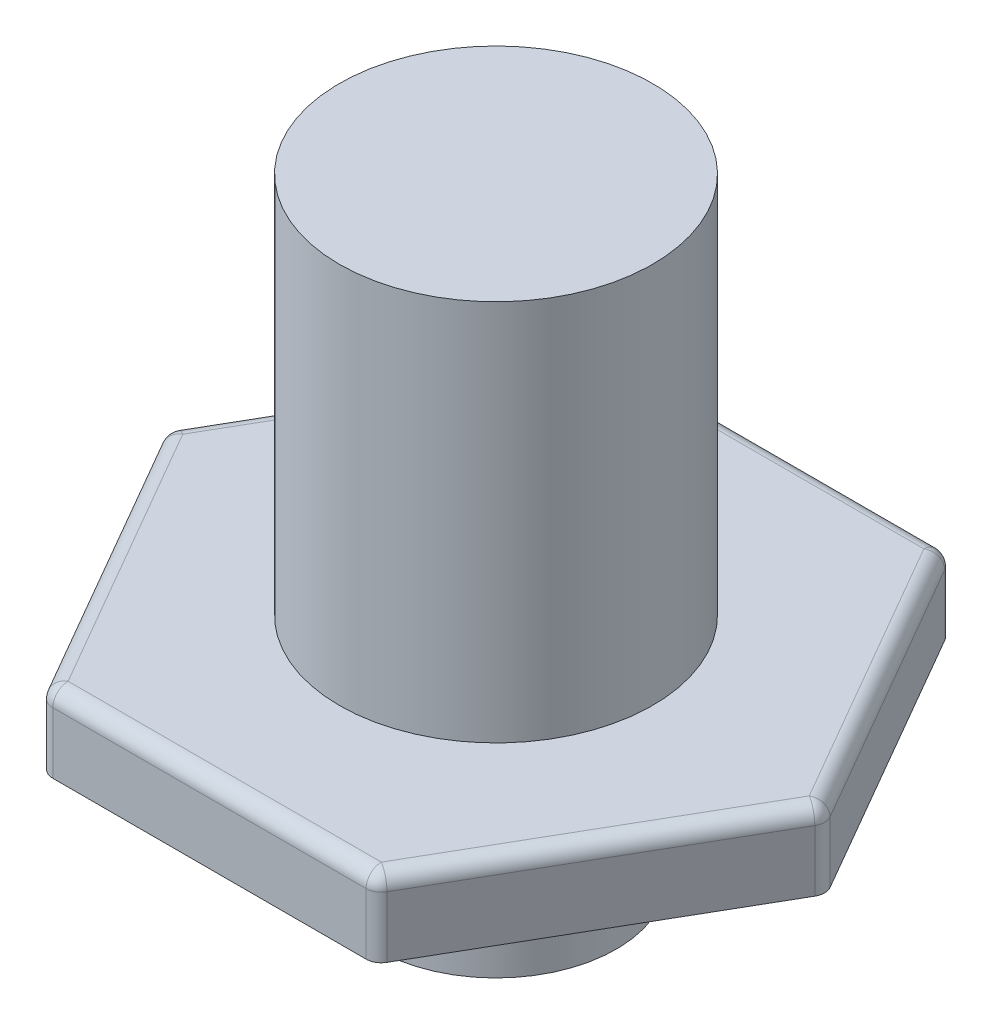
ISO-10303-21;
HEADER;
FILE_DESCRIPTION(('STEP AP214'),'2;1');
FILE_NAME('part.step','',(''),(''),'','','');
FILE_SCHEMA(('AUTOMOTIVE_DESIGN { 1 0 10303 214 1 1 1 1 }'));
ENDSEC;
DATA;
#1=APPLICATION_CONTEXT('core data for automotive mechanical design processes');
#2=APPLICATION_PROTOCOL_DEFINITION('international standard','automotive_design',2000,#1);
#3=PRODUCT_CONTEXT('',#1,'mechanical');
#4=PRODUCT('Part','Part','',(#3));
#5=PRODUCT_RELATED_PRODUCT_CATEGORY('part','',(#4));
#6=PRODUCT_DEFINITION_FORMATION('','',#4);
#7=PRODUCT_DEFINITION_CONTEXT('part definition',#1,'design');
#8=PRODUCT_DEFINITION('design','',#6,#7);
#9=PRODUCT_DEFINITION_SHAPE('','',#8);
#10=(LENGTH_UNIT() NAMED_UNIT(*) SI_UNIT(.MILLI.,.METRE.));
#11=(NAMED_UNIT(*) PLANE_ANGLE_UNIT() SI_UNIT($,.RADIAN.));
#12=(NAMED_UNIT(*) SI_UNIT($,.STERADIAN.) SOLID_ANGLE_UNIT());
#13=UNCERTAINTY_MEASURE_WITH_UNIT(LENGTH_MEASURE(1.E-05),#10,'distance_accuracy_value','');
#14=(GEOMETRIC_REPRESENTATION_CONTEXT(3) GLOBAL_UNCERTAINTY_ASSIGNED_CONTEXT((#13)) GLOBAL_UNIT_ASSIGNED_CONTEXT((#10,
#11,#12)) REPRESENTATION_CONTEXT('',''));
#15=CARTESIAN_POINT('',(0.,0.,0.));
#16=DIRECTION('',(0.,0.,1.));
#17=DIRECTION('',(1.,0.,0.));
#18=AXIS2_PLACEMENT_3D('',#15,#16,#17);
#19=CARTESIAN_POINT('',(5.49926131403119,2.54,9.525));
#20=DIRECTION('',(-0.866025403784439,0.,-0.5));
#21=DIRECTION('',(-0.5,0.,0.866025403784439));
#22=AXIS2_PLACEMENT_3D('',#19,#20,#21);
#23=PLANE('',#22);
#24=DIRECTION('',(0.5,0.,-0.866025403784439));
#25=VECTOR('',#24,1.);
#26=CARTESIAN_POINT('',(5.49926131403119,0.,9.525));
#27=LINE('',#26,#25);
#28=CARTESIAN_POINT('',(5.64590828240535,0.,9.271));
#29=VERTEX_POINT('',#28);
#30=CARTESIAN_POINT('',(10.8518756596882,0.,0.253999999999996));
#31=VERTEX_POINT('',#30);
#32=EDGE_CURVE('E222',#29,#31,#27,.T.);
#33=ORIENTED_EDGE('',*,*,#32,.T.);
#34=DIRECTION('',(0.,-1.,0.));
#35=VECTOR('',#34,1.);
#36=CARTESIAN_POINT('',(10.8518756596882,2.54,0.253999999999997));
#37=LINE('',#36,#35);
#38=CARTESIAN_POINT('',(10.8518756596882,2.032,0.253999999999998));
#39=VERTEX_POINT('',#38);
#40=EDGE_CURVE('E263',#31,#39,#37,.F.);
#41=ORIENTED_EDGE('',*,*,#40,.T.);
#42=DIRECTION('',(0.5,0.,-0.866025403784439));
#43=VECTOR('',#42,1.);
#44=CARTESIAN_POINT('',(5.49926131403119,2.032,9.525));
#45=LINE('',#44,#43);
#46=CARTESIAN_POINT('',(5.64590828240535,2.032,9.271));
#47=VERTEX_POINT('',#46);
#48=EDGE_CURVE('E257',#39,#47,#45,.F.);
#49=ORIENTED_EDGE('',*,*,#48,.T.);
#50=DIRECTION('',(0.,-1.,0.));
#51=VECTOR('',#50,1.);
#52=CARTESIAN_POINT('',(5.64590828240535,2.54,9.271));
#53=LINE('',#52,#51);
#54=EDGE_CURVE('E260',#47,#29,#53,.T.);
#55=ORIENTED_EDGE('',*,*,#54,.T.);
#56=EDGE_LOOP('',(#33,#41,#49,#55));
#57=FACE_BOUND('',#56,.T.);
#58=ADVANCED_FACE('F42',(#57),#23,.F.);
#59=CARTESIAN_POINT('',(10.9985226280624,2.54,0.));
#60=DIRECTION('',(-0.866025403784439,0.,0.5));
#61=DIRECTION('',(0.5,0.,0.866025403784439));
#62=AXIS2_PLACEMENT_3D('',#59,#60,#61);
#63=PLANE('',#62);
#64=DIRECTION('',(-0.5,0.,-0.866025403784439));
#65=VECTOR('',#64,1.);
#66=CARTESIAN_POINT('',(10.9985226280624,0.,0.));
#67=LINE('',#66,#65);
#68=CARTESIAN_POINT('',(10.8518756596882,0.,-0.254));
#69=VERTEX_POINT('',#68);
#70=CARTESIAN_POINT('',(5.64590828240535,0.,-9.271));
#71=VERTEX_POINT('',#70);
#72=EDGE_CURVE('E213',#69,#71,#67,.T.);
#73=ORIENTED_EDGE('',*,*,#72,.T.);
#74=DIRECTION('',(0.,-1.,0.));
#75=VECTOR('',#74,1.);
#76=CARTESIAN_POINT('',(5.64590828240535,2.54,-9.271));
#77=LINE('',#76,#75);
#78=CARTESIAN_POINT('',(5.64590828240535,2.032,-9.271));
#79=VERTEX_POINT('',#78);
#80=EDGE_CURVE('E188',#71,#79,#77,.F.);
#81=ORIENTED_EDGE('',*,*,#80,.T.);
#82=DIRECTION('',(-0.5,0.,-0.866025403784439));
#83=VECTOR('',#82,1.);
#84=CARTESIAN_POINT('',(10.9985226280624,2.032,0.));
#85=LINE('',#84,#83);
#86=CARTESIAN_POINT('',(10.8518756596882,2.032,-0.254));
#87=VERTEX_POINT('',#86);
#88=EDGE_CURVE('E194',#79,#87,#85,.F.);
#89=ORIENTED_EDGE('',*,*,#88,.T.);
#90=DIRECTION('',(0.,-1.,0.));
#91=VECTOR('',#90,1.);
#92=CARTESIAN_POINT('',(10.8518756596882,2.54,-0.254));
#93=LINE('',#92,#91);
#94=EDGE_CURVE('E252',#87,#69,#93,.T.);
#95=ORIENTED_EDGE('',*,*,#94,.T.);
#96=EDGE_LOOP('',(#73,#81,#89,#95));
#97=FACE_BOUND('',#96,.T.);
#98=ADVANCED_FACE('F468',(#97),#63,.F.);
#99=CARTESIAN_POINT('',(5.49926131403119,2.54,-9.525));
#100=DIRECTION('',(0.,0.,1.));
#101=DIRECTION('',(1.,0.,0.));
#102=AXIS2_PLACEMENT_3D('',#99,#100,#101);
#103=PLANE('',#102);
#104=DIRECTION('',(-1.,0.,0.));
#105=VECTOR('',#104,1.);
#106=CARTESIAN_POINT('',(5.49926131403119,2.032,-9.525));
#107=LINE('',#106,#105);
#108=CARTESIAN_POINT('',(-5.20596737728286,2.032,-9.525));
#109=VERTEX_POINT('',#108);
#110=CARTESIAN_POINT('',(5.20596737728286,2.032,-9.525));
#111=VERTEX_POINT('',#110);
#112=EDGE_CURVE('E202',#109,#111,#107,.F.);
#113=ORIENTED_EDGE('',*,*,#112,.T.);
#114=DIRECTION('',(0.,-1.,0.));
#115=VECTOR('',#114,1.);
#116=CARTESIAN_POINT('',(5.20596737728286,2.54,-9.525));
#117=LINE('',#116,#115);
#118=CARTESIAN_POINT('',(5.20596737728286,0.,-9.525));
#119=VERTEX_POINT('',#118);
#120=EDGE_CURVE('E187',#111,#119,#117,.T.);
#121=ORIENTED_EDGE('',*,*,#120,.T.);
#122=DIRECTION('',(-1.,0.,0.));
#123=VECTOR('',#122,1.);
#124=CARTESIAN_POINT('',(5.49926131403119,0.,-9.525));
#125=LINE('',#124,#123);
#126=CARTESIAN_POINT('',(-5.20596737728286,0.,-9.525));
#127=VERTEX_POINT('',#126);
#128=EDGE_CURVE('E200',#119,#127,#125,.T.);
#129=ORIENTED_EDGE('',*,*,#128,.T.);
#130=DIRECTION('',(0.,-1.,0.));
#131=VECTOR('',#130,1.);
#132=CARTESIAN_POINT('',(-5.20596737728286,2.54,-9.525));
#133=LINE('',#132,#131);
#134=EDGE_CURVE('E206',#127,#109,#133,.F.);
#135=ORIENTED_EDGE('',*,*,#134,.T.);
#136=EDGE_LOOP('',(#113,#121,#129,#135));
#137=FACE_BOUND('',#136,.T.);
#138=ADVANCED_FACE('F199',(#137),#103,.F.);
#139=CARTESIAN_POINT('',(-5.49926131403119,2.54,-9.525));
#140=DIRECTION('',(0.866025403784439,0.,0.5));
#141=DIRECTION('',(0.5,0.,-0.866025403784439));
#142=AXIS2_PLACEMENT_3D('',#139,#140,#141);
#143=PLANE('',#142);
#144=DIRECTION('',(-0.5,0.,0.866025403784439));
#145=VECTOR('',#144,1.);
#146=CARTESIAN_POINT('',(-5.49926131403119,0.,-9.525));
#147=LINE('',#146,#145);
#148=CARTESIAN_POINT('',(-5.64590828240535,0.,-9.271));
#149=VERTEX_POINT('',#148);
#150=CARTESIAN_POINT('',(-10.8518756596882,0.,-0.254000000000001));
#151=VERTEX_POINT('',#150);
#152=EDGE_CURVE('E212',#149,#151,#147,.T.);
#153=ORIENTED_EDGE('',*,*,#152,.T.);
#154=DIRECTION('',(0.,-1.,0.));
#155=VECTOR('',#154,1.);
#156=CARTESIAN_POINT('',(-10.8518756596882,2.54,-0.253999999999999));
#157=LINE('',#156,#155);
#158=CARTESIAN_POINT('',(-10.8518756596882,2.032,-0.253999999999999));
#159=VERTEX_POINT('',#158);
#160=EDGE_CURVE('E289',#151,#159,#157,.F.);
#161=ORIENTED_EDGE('',*,*,#160,.T.);
#162=DIRECTION('',(-0.5,0.,0.866025403784439));
#163=VECTOR('',#162,1.);
#164=CARTESIAN_POINT('',(-5.49926131403119,2.032,-9.52500000000001));
#165=LINE('',#164,#163);
#166=CARTESIAN_POINT('',(-5.64590828240535,2.032,-9.271));
#167=VERTEX_POINT('',#166);
#168=EDGE_CURVE('E284',#159,#167,#165,.F.);
#169=ORIENTED_EDGE('',*,*,#168,.T.);
#170=DIRECTION('',(0.,-1.,0.));
#171=VECTOR('',#170,1.);
#172=CARTESIAN_POINT('',(-5.64590828240535,2.54,-9.271));
#173=LINE('',#172,#171);
#174=EDGE_CURVE('E286',#167,#149,#173,.T.);
#175=ORIENTED_EDGE('',*,*,#174,.T.);
#176=EDGE_LOOP('',(#153,#161,#169,#175));
#177=FACE_BOUND('',#176,.T.);
#178=ADVANCED_FACE('F453',(#177),#143,.F.);
#179=CARTESIAN_POINT('',(-10.9985226280624,2.54,0.));
#180=DIRECTION('',(0.866025403784439,0.,-0.5));
#181=DIRECTION('',(-0.5,0.,-0.866025403784439));
#182=AXIS2_PLACEMENT_3D('',#179,#180,#181);
#183=PLANE('',#182);
#184=DIRECTION('',(0.5,0.,0.866025403784439));
#185=VECTOR('',#184,1.);
#186=CARTESIAN_POINT('',(-10.9985226280624,0.,0.));
#187=LINE('',#186,#185);
#188=CARTESIAN_POINT('',(-10.8518756596882,0.,0.254000000000001));
#189=VERTEX_POINT('',#188);
#190=CARTESIAN_POINT('',(-5.64590828240535,0.,9.271));
#191=VERTEX_POINT('',#190);
#192=EDGE_CURVE('E219',#189,#191,#187,.T.);
#193=ORIENTED_EDGE('',*,*,#192,.T.);
#194=DIRECTION('',(0.,-1.,0.));
#195=VECTOR('',#194,1.);
#196=CARTESIAN_POINT('',(-5.64590828240535,2.54,9.271));
#197=LINE('',#196,#195);
#198=CARTESIAN_POINT('',(-5.64590828240535,2.032,9.271));
#199=VERTEX_POINT('',#198);
#200=EDGE_CURVE('E281',#191,#199,#197,.F.);
#201=ORIENTED_EDGE('',*,*,#200,.T.);
#202=DIRECTION('',(0.5,0.,0.866025403784439));
#203=VECTOR('',#202,1.);
#204=CARTESIAN_POINT('',(-10.9985226280624,2.032,0.));
#205=LINE('',#204,#203);
#206=CARTESIAN_POINT('',(-10.8518756596882,2.032,0.254000000000001));
#207=VERTEX_POINT('',#206);
#208=EDGE_CURVE('E275',#199,#207,#205,.F.);
#209=ORIENTED_EDGE('',*,*,#208,.T.);
#210=DIRECTION('',(0.,-1.,0.));
#211=VECTOR('',#210,1.);
#212=CARTESIAN_POINT('',(-10.8518756596882,2.54,0.254000000000001));
#213=LINE('',#212,#211);
#214=EDGE_CURVE('E278',#207,#189,#213,.T.);
#215=ORIENTED_EDGE('',*,*,#214,.T.);
#216=EDGE_LOOP('',(#193,#201,#209,#215));
#217=FACE_BOUND('',#216,.T.);
#218=ADVANCED_FACE('F434',(#217),#183,.F.);
#219=CARTESIAN_POINT('',(-5.49926131403119,2.54,9.525));
#220=DIRECTION('',(0.,0.,-1.));
#221=DIRECTION('',(-1.,0.,0.));
#222=AXIS2_PLACEMENT_3D('',#219,#220,#221);
#223=PLANE('',#222);
#224=DIRECTION('',(1.,0.,0.));
#225=VECTOR('',#224,1.);
#226=CARTESIAN_POINT('',(-5.49926131403119,0.,9.525));
#227=LINE('',#226,#225);
#228=CARTESIAN_POINT('',(-5.20596737728286,0.,9.525));
#229=VERTEX_POINT('',#228);
#230=CARTESIAN_POINT('',(5.20596737728286,0.,9.525));
#231=VERTEX_POINT('',#230);
#232=EDGE_CURVE('E229',#229,#231,#227,.T.);
#233=ORIENTED_EDGE('',*,*,#232,.T.);
#234=DIRECTION('',(0.,-1.,0.));
#235=VECTOR('',#234,1.);
#236=CARTESIAN_POINT('',(5.20596737728286,2.54,9.525));
#237=LINE('',#236,#235);
#238=CARTESIAN_POINT('',(5.20596737728286,2.032,9.525));
#239=VERTEX_POINT('',#238);
#240=EDGE_CURVE('E272',#231,#239,#237,.F.);
#241=ORIENTED_EDGE('',*,*,#240,.T.);
#242=DIRECTION('',(1.,0.,0.));
#243=VECTOR('',#242,1.);
#244=CARTESIAN_POINT('',(-5.49926131403119,2.032,9.525));
#245=LINE('',#244,#243);
#246=CARTESIAN_POINT('',(-5.20596737728286,2.032,9.525));
#247=VERTEX_POINT('',#246);
#248=EDGE_CURVE('E266',#239,#247,#245,.F.);
#249=ORIENTED_EDGE('',*,*,#248,.T.);
#250=DIRECTION('',(0.,-1.,0.));
#251=VECTOR('',#250,1.);
#252=CARTESIAN_POINT('',(-5.20596737728286,2.54,9.525));
#253=LINE('',#252,#251);
#254=EDGE_CURVE('E269',#247,#229,#253,.T.);
#255=ORIENTED_EDGE('',*,*,#254,.T.);
#256=EDGE_LOOP('',(#233,#241,#249,#255));
#257=FACE_BOUND('',#256,.T.);
#258=ADVANCED_FACE('F426',(#257),#223,.F.);
#259=CARTESIAN_POINT('',(0.,2.54,0.));
#260=DIRECTION('',(0.,1.,0.));
#261=DIRECTION('',(0.,0.,1.));
#262=AXIS2_PLACEMENT_3D('',#259,#260,#261);
#263=PLANE('',#262);
#264=DIRECTION('',(-0.5,0.,-0.866025403784439));
#265=VECTOR('',#264,1.);
#266=CARTESIAN_POINT('',(5.05932040890869,2.54,-9.271));
#267=LINE('',#266,#265);
#268=CARTESIAN_POINT('',(10.4119347545657,2.54,0.));
#269=VERTEX_POINT('',#268);
#270=CARTESIAN_POINT('',(5.20596737728286,2.54,-9.017));
#271=VERTEX_POINT('',#270);
#272=EDGE_CURVE('E298',#269,#271,#267,.T.);
#273=ORIENTED_EDGE('',*,*,#272,.T.);
#274=DIRECTION('',(-1.,0.,0.));
#275=VECTOR('',#274,1.);
#276=CARTESIAN_POINT('',(-5.49926131403119,2.54,-9.017));
#277=LINE('',#276,#275);
#278=CARTESIAN_POINT('',(-5.20596737728286,2.54,-9.017));
#279=VERTEX_POINT('',#278);
#280=EDGE_CURVE('E11',#271,#279,#277,.T.);
#281=ORIENTED_EDGE('',*,*,#280,.T.);
#282=DIRECTION('',(-0.5,0.,0.866025403784439));
#283=VECTOR('',#282,1.);
#284=CARTESIAN_POINT('',(-10.5585817229399,2.54,0.254));
#285=LINE('',#284,#283);
#286=CARTESIAN_POINT('',(-10.4119347545657,2.54,0.));
#287=VERTEX_POINT('',#286);
#288=EDGE_CURVE('E52',#279,#287,#285,.T.);
#289=ORIENTED_EDGE('',*,*,#288,.T.);
#290=DIRECTION('',(0.5,0.,0.866025403784439));
#291=VECTOR('',#290,1.);
#292=CARTESIAN_POINT('',(-5.05932040890869,2.54,9.271));
#293=LINE('',#292,#291);
#294=CARTESIAN_POINT('',(-5.20596737728286,2.54,9.017));
#295=VERTEX_POINT('',#294);
#296=EDGE_CURVE('E301',#287,#295,#293,.T.);
#297=ORIENTED_EDGE('',*,*,#296,.T.);
#298=DIRECTION('',(1.,0.,0.));
#299=VECTOR('',#298,1.);
#300=CARTESIAN_POINT('',(5.49926131403119,2.54,9.017));
#301=LINE('',#300,#299);
#302=CARTESIAN_POINT('',(5.20596737728286,2.54,9.017));
#303=VERTEX_POINT('',#302);
#304=EDGE_CURVE('E295',#295,#303,#301,.T.);
#305=ORIENTED_EDGE('',*,*,#304,.T.);
#306=DIRECTION('',(0.5,0.,-0.866025403784439));
#307=VECTOR('',#306,1.);
#308=CARTESIAN_POINT('',(10.5585817229399,2.54,-0.254));
#309=LINE('',#308,#307);
#310=EDGE_CURVE('E292',#303,#269,#309,.T.);
#311=ORIENTED_EDGE('',*,*,#310,.T.);
#312=EDGE_LOOP('',(#273,#281,#289,#297,#305,#311));
#313=FACE_BOUND('',#312,.T.);
#314=CARTESIAN_POINT('',(0.,2.54,0.));
#315=DIRECTION('',(0.,1.,0.));
#316=DIRECTION('',(0.,0.,1.));
#317=AXIS2_PLACEMENT_3D('',#314,#315,#316);
#318=CIRCLE('',#317,5.207);
#319=CARTESIAN_POINT('',(0.,2.54,5.207));
#320=VERTEX_POINT('',#319);
#321=EDGE_CURVE('E380',#320,#320,#318,.T.);
#322=ORIENTED_EDGE('',*,*,#321,.F.);
#323=EDGE_LOOP('',(#322));
#324=FACE_BOUND('',#323,.T.);
#325=ADVANCED_FACE('F535',(#313,#324),#263,.T.);
#326=CARTESIAN_POINT('',(0.,0.,0.));
#327=DIRECTION('',(0.,1.,0.));
#328=DIRECTION('',(0.,0.,1.));
#329=AXIS2_PLACEMENT_3D('',#326,#327,#328);
#330=PLANE('',#329);
#331=CARTESIAN_POINT('',(0.,0.,0.));
#332=DIRECTION('',(0.,-1.,0.));
#333=DIRECTION('',(0.,0.,-1.));
#334=AXIS2_PLACEMENT_3D('',#331,#332,#333);
#335=CIRCLE('',#334,4.);
#336=CARTESIAN_POINT('',(0.,0.,-4.));
#337=VERTEX_POINT('',#336);
#338=EDGE_CURVE('E233',#337,#337,#335,.T.);
#339=ORIENTED_EDGE('',*,*,#338,.F.);
#340=EDGE_LOOP('',(#339));
#341=FACE_BOUND('',#340,.T.);
#342=ORIENTED_EDGE('',*,*,#128,.F.);
#343=CARTESIAN_POINT('',(5.20596737728286,0.,-9.017));
#344=DIRECTION('',(0.,1.,0.));
#345=DIRECTION('',(0.,0.,1.));
#346=AXIS2_PLACEMENT_3D('',#343,#344,#345);
#347=CIRCLE('',#346,0.508);
#348=EDGE_CURVE('E183',#119,#71,#347,.F.);
#349=ORIENTED_EDGE('',*,*,#348,.T.);
#350=ORIENTED_EDGE('',*,*,#72,.F.);
#351=CARTESIAN_POINT('',(10.4119347545657,0.,0.));
#352=DIRECTION('',(0.,1.,0.));
#353=DIRECTION('',(0.,0.,1.));
#354=AXIS2_PLACEMENT_3D('',#351,#352,#353);
#355=CIRCLE('',#354,0.508);
#356=EDGE_CURVE('E195',#69,#31,#355,.F.);
#357=ORIENTED_EDGE('',*,*,#356,.T.);
#358=ORIENTED_EDGE('',*,*,#32,.F.);
#359=CARTESIAN_POINT('',(5.20596737728286,0.,9.017));
#360=DIRECTION('',(0.,1.,0.));
#361=DIRECTION('',(0.,0.,1.));
#362=AXIS2_PLACEMENT_3D('',#359,#360,#361);
#363=CIRCLE('',#362,0.508);
#364=EDGE_CURVE('E245',#29,#231,#363,.F.);
#365=ORIENTED_EDGE('',*,*,#364,.T.);
#366=ORIENTED_EDGE('',*,*,#232,.F.);
#367=CARTESIAN_POINT('',(-5.20596737728286,0.,9.017));
#368=DIRECTION('',(0.,1.,0.));
#369=DIRECTION('',(0.,0.,1.));
#370=AXIS2_PLACEMENT_3D('',#367,#368,#369);
#371=CIRCLE('',#370,0.508);
#372=EDGE_CURVE('E242',#229,#191,#371,.F.);
#373=ORIENTED_EDGE('',*,*,#372,.T.);
#374=ORIENTED_EDGE('',*,*,#192,.F.);
#375=CARTESIAN_POINT('',(-10.4119347545657,0.,0.));
#376=DIRECTION('',(0.,1.,0.));
#377=DIRECTION('',(0.,0.,1.));
#378=AXIS2_PLACEMENT_3D('',#375,#376,#377);
#379=CIRCLE('',#378,0.508);
#380=EDGE_CURVE('E239',#189,#151,#379,.F.);
#381=ORIENTED_EDGE('',*,*,#380,.T.);
#382=ORIENTED_EDGE('',*,*,#152,.F.);
#383=CARTESIAN_POINT('',(-5.20596737728286,0.,-9.017));
#384=DIRECTION('',(0.,1.,0.));
#385=DIRECTION('',(0.,0.,1.));
#386=AXIS2_PLACEMENT_3D('',#383,#384,#385);
#387=CIRCLE('',#386,0.508);
#388=EDGE_CURVE('E205',#149,#127,#387,.F.);
#389=ORIENTED_EDGE('',*,*,#388,.T.);
#390=EDGE_LOOP('',(#342,#349,#350,#357,#358,#365,#366,#373,#374,#381,#382,#389));
#391=FACE_BOUND('',#390,.T.);
#392=ADVANCED_FACE('F208',(#341,#391),#330,.F.);
#393=CARTESIAN_POINT('',(0.,15.24,0.));
#394=DIRECTION('',(0.,-1.,0.));
#395=DIRECTION('',(0.,0.,-1.));
#396=AXIS2_PLACEMENT_3D('',#393,#394,#395);
#397=CYLINDRICAL_SURFACE('',#396,5.207);
#398=CARTESIAN_POINT('',(0.,15.24,0.));
#399=DIRECTION('',(0.,1.,0.));
#400=DIRECTION('',(0.,0.,1.));
#401=AXIS2_PLACEMENT_3D('',#398,#399,#400);
#402=CIRCLE('',#401,5.207);
#403=CARTESIAN_POINT('',(0.,15.24,5.207));
#404=VERTEX_POINT('',#403);
#405=EDGE_CURVE('E386',#404,#404,#402,.T.);
#406=ORIENTED_EDGE('',*,*,#405,.F.);
#407=EDGE_LOOP('',(#406));
#408=FACE_BOUND('',#407,.T.);
#409=ORIENTED_EDGE('',*,*,#321,.T.);
#410=EDGE_LOOP('',(#409));
#411=FACE_BOUND('',#410,.T.);
#412=ADVANCED_FACE('F530',(#408,#411),#397,.T.);
#413=CARTESIAN_POINT('',(0.,15.24,0.));
#414=DIRECTION('',(0.,1.,0.));
#415=DIRECTION('',(0.,0.,1.));
#416=AXIS2_PLACEMENT_3D('',#413,#414,#415);
#417=PLANE('',#416);
#418=ORIENTED_EDGE('',*,*,#405,.T.);
#419=EDGE_LOOP('',(#418));
#420=FACE_BOUND('',#419,.T.);
#421=ADVANCED_FACE('F524',(#420),#417,.T.);
#422=CARTESIAN_POINT('',(0.,-5.08,0.));
#423=DIRECTION('',(0.,1.,0.));
#424=DIRECTION('',(0.,0.,1.));
#425=AXIS2_PLACEMENT_3D('',#422,#423,#424);
#426=CYLINDRICAL_SURFACE('',#425,4.);
#427=CARTESIAN_POINT('',(0.,-5.08,0.));
#428=DIRECTION('',(0.,-1.,0.));
#429=DIRECTION('',(0.,0.,-1.));
#430=AXIS2_PLACEMENT_3D('',#427,#428,#429);
#431=CIRCLE('',#430,4.);
#432=CARTESIAN_POINT('',(0.,-5.08,-4.));
#433=VERTEX_POINT('',#432);
#434=EDGE_CURVE('E374',#433,#433,#431,.T.);
#435=ORIENTED_EDGE('',*,*,#434,.F.);
#436=EDGE_LOOP('',(#435));
#437=FACE_BOUND('',#436,.T.);
#438=ORIENTED_EDGE('',*,*,#338,.T.);
#439=EDGE_LOOP('',(#438));
#440=FACE_BOUND('',#439,.T.);
#441=ADVANCED_FACE('F519',(#437,#440),#426,.T.);
#442=CARTESIAN_POINT('',(0.,-5.08,0.));
#443=DIRECTION('',(0.,-1.,0.));
#444=DIRECTION('',(0.,0.,-1.));
#445=AXIS2_PLACEMENT_3D('',#442,#443,#444);
#446=PLANE('',#445);
#447=ORIENTED_EDGE('',*,*,#434,.T.);
#448=EDGE_LOOP('',(#447));
#449=FACE_BOUND('',#448,.T.);
#450=ADVANCED_FACE('F515',(#449),#446,.T.);
#451=CARTESIAN_POINT('',(-5.20596737728286,2.54,9.017));
#452=DIRECTION('',(0.,-1.,0.));
#453=DIRECTION('',(0.,0.,-1.));
#454=AXIS2_PLACEMENT_3D('',#451,#452,#453);
#455=CYLINDRICAL_SURFACE('',#454,0.508);
#456=CARTESIAN_POINT('',(-5.20596737728286,2.032,9.017));
#457=DIRECTION('',(0.,1.,0.));
#458=DIRECTION('',(0.,0.,1.));
#459=AXIS2_PLACEMENT_3D('',#456,#457,#458);
#460=CIRCLE('',#459,0.508);
#461=EDGE_CURVE('E46',#199,#247,#460,.T.);
#462=ORIENTED_EDGE('',*,*,#461,.F.);
#463=ORIENTED_EDGE('',*,*,#200,.F.);
#464=ORIENTED_EDGE('',*,*,#372,.F.);
#465=ORIENTED_EDGE('',*,*,#254,.F.);
#466=EDGE_LOOP('',(#462,#463,#464,#465));
#467=FACE_BOUND('',#466,.T.);
#468=ADVANCED_FACE('F44',(#467),#455,.T.);
#469=CARTESIAN_POINT('',(-5.20596737728286,2.032,9.017));
#470=DIRECTION('',(0.,0.,1.));
#471=DIRECTION('',(1.,0.,0.));
#472=AXIS2_PLACEMENT_3D('',#469,#470,#471);
#473=SPHERICAL_SURFACE('',#472,0.508);
#474=CARTESIAN_POINT('',(-5.20596737728286,2.032,9.017));
#475=DIRECTION('',(0.500000000000002,0.,0.866025403784437));
#476=DIRECTION('',(0.866025403784437,0.,-0.500000000000003));
#477=AXIS2_PLACEMENT_3D('',#474,#475,#476);
#478=CIRCLE('',#477,0.508);
#479=EDGE_CURVE('E362',#199,#295,#478,.F.);
#480=ORIENTED_EDGE('',*,*,#479,.F.);
#481=ORIENTED_EDGE('',*,*,#461,.T.);
#482=CARTESIAN_POINT('',(-5.20596737728286,2.032,9.017));
#483=DIRECTION('',(-1.,0.,0.));
#484=DIRECTION('',(0.,-1.,0.));
#485=AXIS2_PLACEMENT_3D('',#482,#483,#484);
#486=CIRCLE('',#485,0.508);
#487=EDGE_CURVE('E365',#295,#247,#486,.F.);
#488=ORIENTED_EDGE('',*,*,#487,.F.);
#489=EDGE_LOOP('',(#480,#481,#488));
#490=FACE_BOUND('',#489,.T.);
#491=ADVANCED_FACE('F510',(#490),#473,.T.);
#492=CARTESIAN_POINT('',(5.20596737728286,2.54,9.017));
#493=DIRECTION('',(0.,-1.,0.));
#494=DIRECTION('',(0.,0.,-1.));
#495=AXIS2_PLACEMENT_3D('',#492,#493,#494);
#496=CYLINDRICAL_SURFACE('',#495,0.508);
#497=ORIENTED_EDGE('',*,*,#364,.F.);
#498=ORIENTED_EDGE('',*,*,#54,.F.);
#499=CARTESIAN_POINT('',(5.20596737728286,2.032,9.017));
#500=DIRECTION('',(0.,1.,0.));
#501=DIRECTION('',(0.,0.,1.));
#502=AXIS2_PLACEMENT_3D('',#499,#500,#501);
#503=CIRCLE('',#502,0.508);
#504=EDGE_CURVE('E358',#239,#47,#503,.T.);
#505=ORIENTED_EDGE('',*,*,#504,.F.);
#506=ORIENTED_EDGE('',*,*,#240,.F.);
#507=EDGE_LOOP('',(#497,#498,#505,#506));
#508=FACE_BOUND('',#507,.T.);
#509=ADVANCED_FACE('F418',(#508),#496,.T.);
#510=CARTESIAN_POINT('',(0.,2.032,9.017));
#511=DIRECTION('',(-1.,0.,0.));
#512=DIRECTION('',(0.,0.,1.));
#513=AXIS2_PLACEMENT_3D('',#510,#511,#512);
#514=CYLINDRICAL_SURFACE('',#513,0.508);
#515=ORIENTED_EDGE('',*,*,#487,.T.);
#516=ORIENTED_EDGE('',*,*,#248,.F.);
#517=CARTESIAN_POINT('',(5.20596737728286,2.032,9.017));
#518=DIRECTION('',(1.,0.,0.));
#519=DIRECTION('',(0.,0.,-1.));
#520=AXIS2_PLACEMENT_3D('',#517,#518,#519);
#521=CIRCLE('',#520,0.508);
#522=EDGE_CURVE('E354',#303,#239,#521,.T.);
#523=ORIENTED_EDGE('',*,*,#522,.F.);
#524=ORIENTED_EDGE('',*,*,#304,.F.);
#525=EDGE_LOOP('',(#515,#516,#523,#524));
#526=FACE_BOUND('',#525,.T.);
#527=ADVANCED_FACE('F423',(#526),#514,.T.);
#528=CARTESIAN_POINT('',(-7.80895106592429,2.032,4.5085));
#529=DIRECTION('',(-0.5,0.,-0.866025403784439));
#530=DIRECTION('',(-0.866025403784439,0.,0.5));
#531=AXIS2_PLACEMENT_3D('',#528,#529,#530);
#532=CYLINDRICAL_SURFACE('',#531,0.508);
#533=ORIENTED_EDGE('',*,*,#479,.T.);
#534=ORIENTED_EDGE('',*,*,#296,.F.);
#535=CARTESIAN_POINT('',(-10.4119347545657,2.032,0.));
#536=DIRECTION('',(-0.500000000000001,0.,-0.866025403784438));
#537=DIRECTION('',(-0.866025403784438,0.,0.500000000000001));
#538=AXIS2_PLACEMENT_3D('',#535,#536,#537);
#539=CIRCLE('',#538,0.508);
#540=EDGE_CURVE('E350',#207,#287,#539,.T.);
#541=ORIENTED_EDGE('',*,*,#540,.F.);
#542=ORIENTED_EDGE('',*,*,#208,.F.);
#543=EDGE_LOOP('',(#533,#534,#541,#542));
#544=FACE_BOUND('',#543,.T.);
#545=ADVANCED_FACE('F444',(#544),#532,.T.);
#546=CARTESIAN_POINT('',(-10.4119347545657,2.54,0.));
#547=DIRECTION('',(0.,-1.,0.));
#548=DIRECTION('',(0.,0.,-1.));
#549=AXIS2_PLACEMENT_3D('',#546,#547,#548);
#550=CYLINDRICAL_SURFACE('',#549,0.508);
#551=ORIENTED_EDGE('',*,*,#380,.F.);
#552=ORIENTED_EDGE('',*,*,#214,.F.);
#553=CARTESIAN_POINT('',(-10.4119347545657,2.032,0.));
#554=DIRECTION('',(0.,1.,0.));
#555=DIRECTION('',(0.,0.,1.));
#556=AXIS2_PLACEMENT_3D('',#553,#554,#555);
#557=CIRCLE('',#556,0.508);
#558=EDGE_CURVE('E346',#159,#207,#557,.T.);
#559=ORIENTED_EDGE('',*,*,#558,.F.);
#560=ORIENTED_EDGE('',*,*,#160,.F.);
#561=EDGE_LOOP('',(#551,#552,#559,#560));
#562=FACE_BOUND('',#561,.T.);
#563=ADVANCED_FACE('F440',(#562),#550,.T.);
#564=CARTESIAN_POINT('',(5.20596737728286,2.032,9.017));
#565=DIRECTION('',(0.,0.,1.));
#566=DIRECTION('',(1.,0.,0.));
#567=AXIS2_PLACEMENT_3D('',#564,#565,#566);
#568=SPHERICAL_SURFACE('',#567,0.508);
#569=ORIENTED_EDGE('',*,*,#522,.T.);
#570=ORIENTED_EDGE('',*,*,#504,.T.);
#571=CARTESIAN_POINT('',(5.20596737728286,2.032,9.017));
#572=DIRECTION('',(-0.499999999999999,0.,0.866025403784439));
#573=DIRECTION('',(0.866025403784439,0.,0.499999999999999));
#574=AXIS2_PLACEMENT_3D('',#571,#572,#573);
#575=CIRCLE('',#574,0.508);
#576=EDGE_CURVE('E342',#303,#47,#575,.F.);
#577=ORIENTED_EDGE('',*,*,#576,.F.);
#578=EDGE_LOOP('',(#569,#570,#577));
#579=FACE_BOUND('',#578,.T.);
#580=ADVANCED_FACE('F421',(#579),#568,.T.);
#581=CARTESIAN_POINT('',(-10.4119347545657,2.032,0.));
#582=DIRECTION('',(0.,0.,1.));
#583=DIRECTION('',(1.,0.,0.));
#584=AXIS2_PLACEMENT_3D('',#581,#582,#583);
#585=SPHERICAL_SURFACE('',#584,0.508);
#586=ORIENTED_EDGE('',*,*,#558,.T.);
#587=ORIENTED_EDGE('',*,*,#540,.T.);
#588=CARTESIAN_POINT('',(-10.4119347545657,2.032,0.));
#589=DIRECTION('',(-0.500000000000002,0.,0.866025403784437));
#590=DIRECTION('',(0.866025403784438,0.,0.500000000000002));
#591=AXIS2_PLACEMENT_3D('',#588,#589,#590);
#592=CIRCLE('',#591,0.508);
#593=EDGE_CURVE('E338',#159,#287,#592,.F.);
#594=ORIENTED_EDGE('',*,*,#593,.F.);
#595=EDGE_LOOP('',(#586,#587,#594));
#596=FACE_BOUND('',#595,.T.);
#597=ADVANCED_FACE('F446',(#596),#585,.T.);
#598=CARTESIAN_POINT('',(10.4119347545657,2.54,0.));
#599=DIRECTION('',(0.,-1.,0.));
#600=DIRECTION('',(0.,0.,-1.));
#601=AXIS2_PLACEMENT_3D('',#598,#599,#600);
#602=CYLINDRICAL_SURFACE('',#601,0.508);
#603=ORIENTED_EDGE('',*,*,#356,.F.);
#604=ORIENTED_EDGE('',*,*,#94,.F.);
#605=CARTESIAN_POINT('',(10.4119347545657,2.032,0.));
#606=DIRECTION('',(0.,1.,0.));
#607=DIRECTION('',(0.,0.,1.));
#608=AXIS2_PLACEMENT_3D('',#605,#606,#607);
#609=CIRCLE('',#608,0.508);
#610=EDGE_CURVE('E334',#39,#87,#609,.T.);
#611=ORIENTED_EDGE('',*,*,#610,.F.);
#612=ORIENTED_EDGE('',*,*,#40,.F.);
#613=EDGE_LOOP('',(#603,#604,#611,#612));
#614=FACE_BOUND('',#613,.T.);
#615=ADVANCED_FACE('F405',(#614),#602,.T.);
#616=CARTESIAN_POINT('',(7.80895106592429,2.032,4.5085));
#617=DIRECTION('',(-0.5,0.,0.866025403784439));
#618=DIRECTION('',(0.866025403784439,0.,0.5));
#619=AXIS2_PLACEMENT_3D('',#616,#617,#618);
#620=CYLINDRICAL_SURFACE('',#619,0.508);
#621=ORIENTED_EDGE('',*,*,#576,.T.);
#622=ORIENTED_EDGE('',*,*,#48,.F.);
#623=CARTESIAN_POINT('',(10.4119347545657,2.032,0.));
#624=DIRECTION('',(0.5,0.,-0.866025403784438));
#625=DIRECTION('',(-0.866025403784439,0.,-0.5));
#626=AXIS2_PLACEMENT_3D('',#623,#624,#625);
#627=CIRCLE('',#626,0.508);
#628=EDGE_CURVE('E330',#269,#39,#627,.T.);
#629=ORIENTED_EDGE('',*,*,#628,.F.);
#630=ORIENTED_EDGE('',*,*,#310,.F.);
#631=EDGE_LOOP('',(#621,#622,#629,#630));
#632=FACE_BOUND('',#631,.T.);
#633=ADVANCED_FACE('F414',(#632),#620,.T.);
#634=CARTESIAN_POINT('',(-7.80895106592429,2.032,-4.5085));
#635=DIRECTION('',(0.5,0.,-0.866025403784439));
#636=DIRECTION('',(-0.866025403784439,0.,-0.5));
#637=AXIS2_PLACEMENT_3D('',#634,#635,#636);
#638=CYLINDRICAL_SURFACE('',#637,0.508);
#639=ORIENTED_EDGE('',*,*,#593,.T.);
#640=ORIENTED_EDGE('',*,*,#288,.F.);
#641=CARTESIAN_POINT('',(-5.20596737728286,2.032,-9.017));
#642=DIRECTION('',(0.500000000000001,0.,-0.866025403784438));
#643=DIRECTION('',(-0.866025403784438,0.,-0.500000000000001));
#644=AXIS2_PLACEMENT_3D('',#641,#642,#643);
#645=CIRCLE('',#644,0.508);
#646=EDGE_CURVE('E327',#167,#279,#645,.T.);
#647=ORIENTED_EDGE('',*,*,#646,.F.);
#648=ORIENTED_EDGE('',*,*,#168,.F.);
#649=EDGE_LOOP('',(#639,#640,#647,#648));
#650=FACE_BOUND('',#649,.T.);
#651=ADVANCED_FACE('F450',(#650),#638,.T.);
#652=CARTESIAN_POINT('',(-5.20596737728286,2.54,-9.017));
#653=DIRECTION('',(0.,-1.,0.));
#654=DIRECTION('',(0.,0.,-1.));
#655=AXIS2_PLACEMENT_3D('',#652,#653,#654);
#656=CYLINDRICAL_SURFACE('',#655,0.508);
#657=ORIENTED_EDGE('',*,*,#388,.F.);
#658=ORIENTED_EDGE('',*,*,#174,.F.);
#659=CARTESIAN_POINT('',(-5.20596737728286,2.032,-9.017));
#660=DIRECTION('',(0.,1.,0.));
#661=DIRECTION('',(0.,0.,1.));
#662=AXIS2_PLACEMENT_3D('',#659,#660,#661);
#663=CIRCLE('',#662,0.508);
#664=EDGE_CURVE('E323',#109,#167,#663,.T.);
#665=ORIENTED_EDGE('',*,*,#664,.F.);
#666=ORIENTED_EDGE('',*,*,#134,.F.);
#667=EDGE_LOOP('',(#657,#658,#665,#666));
#668=FACE_BOUND('',#667,.T.);
#669=ADVANCED_FACE('F456',(#668),#656,.T.);
#670=CARTESIAN_POINT('',(10.4119347545657,2.032,0.));
#671=DIRECTION('',(0.,0.,1.));
#672=DIRECTION('',(1.,0.,0.));
#673=AXIS2_PLACEMENT_3D('',#670,#671,#672);
#674=SPHERICAL_SURFACE('',#673,0.508);
#675=ORIENTED_EDGE('',*,*,#628,.T.);
#676=ORIENTED_EDGE('',*,*,#610,.T.);
#677=CARTESIAN_POINT('',(10.4119347545657,2.032,0.));
#678=DIRECTION('',(0.500000000000001,0.,0.866025403784438));
#679=DIRECTION('',(0.866025403784438,0.,-0.500000000000001));
#680=AXIS2_PLACEMENT_3D('',#677,#678,#679);
#681=CIRCLE('',#680,0.508);
#682=EDGE_CURVE('E319',#269,#87,#681,.F.);
#683=ORIENTED_EDGE('',*,*,#682,.F.);
#684=EDGE_LOOP('',(#675,#676,#683));
#685=FACE_BOUND('',#684,.T.);
#686=ADVANCED_FACE('F410',(#685),#674,.T.);
#687=CARTESIAN_POINT('',(-5.20596737728286,2.032,-9.017));
#688=DIRECTION('',(0.,0.,1.));
#689=DIRECTION('',(1.,0.,0.));
#690=AXIS2_PLACEMENT_3D('',#687,#688,#689);
#691=SPHERICAL_SURFACE('',#690,0.508);
#692=ORIENTED_EDGE('',*,*,#664,.T.);
#693=ORIENTED_EDGE('',*,*,#646,.T.);
#694=CARTESIAN_POINT('',(-5.20596737728286,2.032,-9.017));
#695=DIRECTION('',(-1.,0.,0.));
#696=DIRECTION('',(0.,0.,1.));
#697=AXIS2_PLACEMENT_3D('',#694,#695,#696);
#698=CIRCLE('',#697,0.508);
#699=EDGE_CURVE('E63',#109,#279,#698,.F.);
#700=ORIENTED_EDGE('',*,*,#699,.F.);
#701=EDGE_LOOP('',(#692,#693,#700));
#702=FACE_BOUND('',#701,.T.);
#703=ADVANCED_FACE('F458',(#702),#691,.T.);
#704=CARTESIAN_POINT('',(7.80895106592429,2.032,-4.5085));
#705=DIRECTION('',(0.5,0.,0.866025403784439));
#706=DIRECTION('',(0.866025403784439,0.,-0.5));
#707=AXIS2_PLACEMENT_3D('',#704,#705,#706);
#708=CYLINDRICAL_SURFACE('',#707,0.508);
#709=ORIENTED_EDGE('',*,*,#682,.T.);
#710=ORIENTED_EDGE('',*,*,#88,.F.);
#711=CARTESIAN_POINT('',(5.20596737728286,2.032,-9.017));
#712=DIRECTION('',(-0.500000000000002,0.,-0.866025403784438));
#713=DIRECTION('',(-0.866025403784438,0.,0.500000000000002));
#714=AXIS2_PLACEMENT_3D('',#711,#712,#713);
#715=CIRCLE('',#714,0.508);
#716=EDGE_CURVE('E313',#271,#79,#715,.T.);
#717=ORIENTED_EDGE('',*,*,#716,.F.);
#718=ORIENTED_EDGE('',*,*,#272,.F.);
#719=EDGE_LOOP('',(#709,#710,#717,#718));
#720=FACE_BOUND('',#719,.T.);
#721=ADVANCED_FACE('F466',(#720),#708,.T.);
#722=CARTESIAN_POINT('',(0.,2.032,-9.017));
#723=DIRECTION('',(1.,0.,0.));
#724=DIRECTION('',(0.,0.,-1.));
#725=AXIS2_PLACEMENT_3D('',#722,#723,#724);
#726=CYLINDRICAL_SURFACE('',#725,0.508);
#727=ORIENTED_EDGE('',*,*,#699,.T.);
#728=ORIENTED_EDGE('',*,*,#280,.F.);
#729=CARTESIAN_POINT('',(5.20596737728286,2.032,-9.017));
#730=DIRECTION('',(1.,0.,0.));
#731=DIRECTION('',(0.,1.,0.));
#732=AXIS2_PLACEMENT_3D('',#729,#730,#731);
#733=CIRCLE('',#732,0.508);
#734=EDGE_CURVE('E309',#111,#271,#733,.T.);
#735=ORIENTED_EDGE('',*,*,#734,.F.);
#736=ORIENTED_EDGE('',*,*,#112,.F.);
#737=EDGE_LOOP('',(#727,#728,#735,#736));
#738=FACE_BOUND('',#737,.T.);
#739=ADVANCED_FACE('F459',(#738),#726,.T.);
#740=CARTESIAN_POINT('',(5.20596737728286,2.032,-9.017));
#741=DIRECTION('',(0.,0.,1.));
#742=DIRECTION('',(1.,0.,0.));
#743=AXIS2_PLACEMENT_3D('',#740,#741,#742);
#744=SPHERICAL_SURFACE('',#743,0.508);
#745=ORIENTED_EDGE('',*,*,#734,.T.);
#746=ORIENTED_EDGE('',*,*,#716,.T.);
#747=CARTESIAN_POINT('',(5.20596737728286,2.032,-9.017));
#748=DIRECTION('',(0.,1.,0.));
#749=DIRECTION('',(0.,0.,1.));
#750=AXIS2_PLACEMENT_3D('',#747,#748,#749);
#751=CIRCLE('',#750,0.508);
#752=EDGE_CURVE('E306',#111,#79,#751,.F.);
#753=ORIENTED_EDGE('',*,*,#752,.F.);
#754=EDGE_LOOP('',(#745,#746,#753));
#755=FACE_BOUND('',#754,.T.);
#756=ADVANCED_FACE('F463',(#755),#744,.T.);
#757=CARTESIAN_POINT('',(5.20596737728286,2.54,-9.017));
#758=DIRECTION('',(0.,-1.,0.));
#759=DIRECTION('',(0.,0.,-1.));
#760=AXIS2_PLACEMENT_3D('',#757,#758,#759);
#761=CYLINDRICAL_SURFACE('',#760,0.508);
#762=ORIENTED_EDGE('',*,*,#752,.T.);
#763=ORIENTED_EDGE('',*,*,#80,.F.);
#764=ORIENTED_EDGE('',*,*,#348,.F.);
#765=ORIENTED_EDGE('',*,*,#120,.F.);
#766=EDGE_LOOP('',(#762,#763,#764,#765));
#767=FACE_BOUND('',#766,.T.);
#768=ADVANCED_FACE('F186',(#767),#761,.T.);
#769=CLOSED_SHELL('',(#58,#98,#138,#178,#218,#258,#325,#392,#412,#421,#441,#450,#468,#491,#509,
#527,#545,#563,#580,#597,#615,#633,#651,#669,#686,#703,#721,#739,#756,#768));
#770=MANIFOLD_SOLID_BREP('B2',#769);
#771=ADVANCED_BREP_SHAPE_REPRESENTATION('',(#18,#770),#14);
#772=SHAPE_DEFINITION_REPRESENTATION(#9,#771);
ENDSEC;
END-ISO-10303-21;
